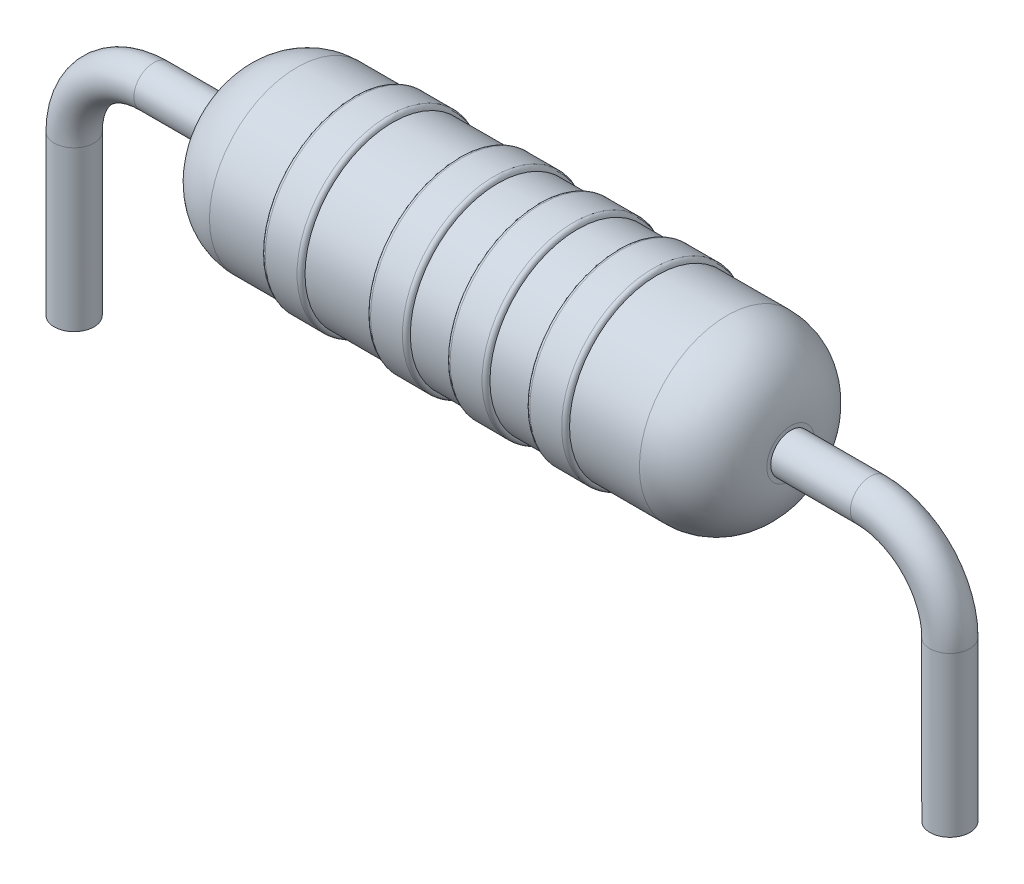
ISO-10303-21;
HEADER;
FILE_DESCRIPTION(('STEP AP214'),'2;1');
FILE_NAME('part.step','',(''),(''),'','','');
FILE_SCHEMA(('AUTOMOTIVE_DESIGN { 1 0 10303 214 1 1 1 1 }'));
ENDSEC;
DATA;
#1=APPLICATION_CONTEXT('core data for automotive mechanical design processes');
#2=APPLICATION_PROTOCOL_DEFINITION('international standard','automotive_design',2000,#1);
#3=PRODUCT_CONTEXT('',#1,'mechanical');
#4=PRODUCT('Part','Part','',(#3));
#5=PRODUCT_RELATED_PRODUCT_CATEGORY('part','',(#4));
#6=PRODUCT_DEFINITION_FORMATION('','',#4);
#7=PRODUCT_DEFINITION_CONTEXT('part definition',#1,'design');
#8=PRODUCT_DEFINITION('design','',#6,#7);
#9=PRODUCT_DEFINITION_SHAPE('','',#8);
#10=(LENGTH_UNIT() NAMED_UNIT(*) SI_UNIT(.MILLI.,.METRE.));
#11=(NAMED_UNIT(*) PLANE_ANGLE_UNIT() SI_UNIT($,.RADIAN.));
#12=(NAMED_UNIT(*) SI_UNIT($,.STERADIAN.) SOLID_ANGLE_UNIT());
#13=UNCERTAINTY_MEASURE_WITH_UNIT(LENGTH_MEASURE(1.E-05),#10,'distance_accuracy_value','');
#14=(GEOMETRIC_REPRESENTATION_CONTEXT(3) GLOBAL_UNCERTAINTY_ASSIGNED_CONTEXT((#13)) GLOBAL_UNIT_ASSIGNED_CONTEXT((#10,
#11,#12)) REPRESENTATION_CONTEXT('',''));
#15=CARTESIAN_POINT('',(0.,0.,0.));
#16=DIRECTION('',(0.,0.,1.));
#17=DIRECTION('',(1.,0.,0.));
#18=AXIS2_PLACEMENT_3D('',#15,#16,#17);
#19=CARTESIAN_POINT('',(-3.5,0.,0.));
#20=DIRECTION('',(1.,0.,0.));
#21=DIRECTION('',(0.,0.,-1.));
#22=AXIS2_PLACEMENT_3D('',#19,#20,#21);
#23=PLANE('',#22);
#24=CARTESIAN_POINT('',(-3.5,0.,0.));
#25=DIRECTION('',(-1.,0.,0.));
#26=DIRECTION('',(0.,0.,1.));
#27=AXIS2_PLACEMENT_3D('',#24,#25,#26);
#28=CIRCLE('',#27,0.299999999999995);
#29=CARTESIAN_POINT('',(-3.5,0.,0.299999999999995));
#30=VERTEX_POINT('',#29);
#31=EDGE_CURVE('E53',#30,#30,#28,.T.);
#32=ORIENTED_EDGE('',*,*,#31,.T.);
#33=EDGE_LOOP('',(#32));
#34=FACE_BOUND('',#33,.T.);
#35=CARTESIAN_POINT('',(-3.5,0.,0.));
#36=DIRECTION('',(-1.,0.,0.));
#37=DIRECTION('',(0.,0.,1.));
#38=AXIS2_PLACEMENT_3D('',#35,#36,#37);
#39=CIRCLE('',#38,0.25);
#40=CARTESIAN_POINT('',(-3.5,0.,0.25));
#41=VERTEX_POINT('',#40);
#42=EDGE_CURVE('E10',#41,#41,#39,.T.);
#43=ORIENTED_EDGE('',*,*,#42,.F.);
#44=EDGE_LOOP('',(#43));
#45=FACE_BOUND('',#44,.T.);
#46=ADVANCED_FACE('F26',(#34,#45),#23,.F.);
#47=CARTESIAN_POINT('',(-54.2686615886834,0.,0.));
#48=DIRECTION('',(-1.,0.,0.));
#49=DIRECTION('',(0.,0.,1.));
#50=AXIS2_PLACEMENT_3D('',#47,#48,#49);
#51=CYLINDRICAL_SURFACE('',#50,1.1);
#52=CARTESIAN_POINT('',(0.322975145638588,0.,0.));
#53=DIRECTION('',(-1.,0.,0.));
#54=DIRECTION('',(0.,0.,1.));
#55=AXIS2_PLACEMENT_3D('',#52,#53,#54);
#56=CIRCLE('',#55,1.1);
#57=CARTESIAN_POINT('',(0.322975145638588,0.,1.1));
#58=VERTEX_POINT('',#57);
#59=EDGE_CURVE('E73',#58,#58,#56,.T.);
#60=ORIENTED_EDGE('',*,*,#59,.T.);
#61=EDGE_LOOP('',(#60));
#62=FACE_BOUND('',#61,.T.);
#63=CARTESIAN_POINT('',(-0.177024854361413,0.,0.));
#64=DIRECTION('',(1.,0.,0.));
#65=DIRECTION('',(0.,0.,-1.));
#66=AXIS2_PLACEMENT_3D('',#63,#64,#65);
#67=CIRCLE('',#66,1.1);
#68=CARTESIAN_POINT('',(-0.177024854361413,0.,-1.1));
#69=VERTEX_POINT('',#68);
#70=EDGE_CURVE('E57',#69,#69,#67,.T.);
#71=ORIENTED_EDGE('',*,*,#70,.T.);
#72=EDGE_LOOP('',(#71));
#73=FACE_BOUND('',#72,.T.);
#74=ADVANCED_FACE('F141',(#62,#73),#51,.T.);
#75=CARTESIAN_POINT('',(4.3261723446646,0.,0.));
#76=DIRECTION('',(1.,0.,0.));
#77=DIRECTION('',(0.,0.,-1.));
#78=AXIS2_PLACEMENT_3D('',#75,#76,#77);
#79=CYLINDRICAL_SURFACE('',#78,1.15);
#80=CARTESIAN_POINT('',(-0.627024854361412,0.,0.));
#81=DIRECTION('',(-1.,0.,0.));
#82=DIRECTION('',(0.,0.,1.));
#83=AXIS2_PLACEMENT_3D('',#80,#81,#82);
#84=CIRCLE('',#83,1.15);
#85=CARTESIAN_POINT('',(-0.627024854361412,0.,1.15));
#86=VERTEX_POINT('',#85);
#87=EDGE_CURVE('E97',#86,#86,#84,.F.);
#88=ORIENTED_EDGE('',*,*,#87,.T.);
#89=EDGE_LOOP('',(#88));
#90=FACE_BOUND('',#89,.T.);
#91=CARTESIAN_POINT('',(-0.227024854361414,0.,0.));
#92=DIRECTION('',(1.,0.,0.));
#93=DIRECTION('',(0.,0.,-1.));
#94=AXIS2_PLACEMENT_3D('',#91,#92,#93);
#95=CIRCLE('',#94,1.15);
#96=CARTESIAN_POINT('',(-0.227024854361414,0.,-1.15));
#97=VERTEX_POINT('',#96);
#98=EDGE_CURVE('E94',#97,#97,#95,.F.);
#99=ORIENTED_EDGE('',*,*,#98,.T.);
#100=EDGE_LOOP('',(#99));
#101=FACE_BOUND('',#100,.T.);
#102=ADVANCED_FACE('F147',(#90,#101),#79,.T.);
#103=CARTESIAN_POINT('',(-1.5,0.,0.));
#104=DIRECTION('',(1.,0.,0.));
#105=DIRECTION('',(0.,0.,-1.));
#106=AXIS2_PLACEMENT_3D('',#103,#104,#105);
#107=CIRCLE('',#106,1.1);
#108=CARTESIAN_POINT('',(-1.5,0.,-1.1));
#109=VERTEX_POINT('',#108);
#110=EDGE_CURVE('E52',#109,#109,#107,.T.);
#111=ORIENTED_EDGE('',*,*,#110,.T.);
#112=EDGE_LOOP('',(#111));
#113=FACE_BOUND('',#112,.T.);
#114=CARTESIAN_POINT('',(-0.677024854361413,0.,0.));
#115=DIRECTION('',(-1.,0.,0.));
#116=DIRECTION('',(0.,0.,1.));
#117=AXIS2_PLACEMENT_3D('',#114,#115,#116);
#118=CIRCLE('',#117,1.1);
#119=CARTESIAN_POINT('',(-0.677024854361413,0.,1.1));
#120=VERTEX_POINT('',#119);
#121=EDGE_CURVE('E67',#120,#120,#118,.T.);
#122=ORIENTED_EDGE('',*,*,#121,.T.);
#123=EDGE_LOOP('',(#122));
#124=FACE_BOUND('',#123,.T.);
#125=ADVANCED_FACE('F149',(#113,#124),#51,.T.);
#126=CARTESIAN_POINT('',(4.3261723446646,0.,0.));
#127=DIRECTION('',(1.,0.,0.));
#128=DIRECTION('',(0.,0.,-1.));
#129=AXIS2_PLACEMENT_3D('',#126,#127,#128);
#130=CYLINDRICAL_SURFACE('',#129,1.15);
#131=CARTESIAN_POINT('',(0.372975145638589,0.,0.));
#132=DIRECTION('',(-1.,0.,0.));
#133=DIRECTION('',(0.,0.,1.));
#134=AXIS2_PLACEMENT_3D('',#131,#132,#133);
#135=CIRCLE('',#134,1.15);
#136=CARTESIAN_POINT('',(0.372975145638589,0.,1.15));
#137=VERTEX_POINT('',#136);
#138=EDGE_CURVE('E103',#137,#137,#135,.F.);
#139=ORIENTED_EDGE('',*,*,#138,.T.);
#140=EDGE_LOOP('',(#139));
#141=FACE_BOUND('',#140,.T.);
#142=CARTESIAN_POINT('',(0.772975145638587,0.,0.));
#143=DIRECTION('',(1.,0.,0.));
#144=DIRECTION('',(0.,0.,-1.));
#145=AXIS2_PLACEMENT_3D('',#142,#143,#144);
#146=CIRCLE('',#145,1.15);
#147=CARTESIAN_POINT('',(0.772975145638587,0.,-1.15));
#148=VERTEX_POINT('',#147);
#149=EDGE_CURVE('E100',#148,#148,#146,.F.);
#150=ORIENTED_EDGE('',*,*,#149,.T.);
#151=EDGE_LOOP('',(#150));
#152=FACE_BOUND('',#151,.T.);
#153=ADVANCED_FACE('F158',(#141,#152),#130,.T.);
#154=CARTESIAN_POINT('',(1.32297514563859,0.,0.));
#155=DIRECTION('',(-1.,0.,0.));
#156=DIRECTION('',(0.,0.,1.));
#157=AXIS2_PLACEMENT_3D('',#154,#155,#156);
#158=CIRCLE('',#157,1.1);
#159=CARTESIAN_POINT('',(1.32297514563859,0.,1.1));
#160=VERTEX_POINT('',#159);
#161=EDGE_CURVE('E79',#160,#160,#158,.T.);
#162=ORIENTED_EDGE('',*,*,#161,.T.);
#163=EDGE_LOOP('',(#162));
#164=FACE_BOUND('',#163,.T.);
#165=CARTESIAN_POINT('',(0.822975145638588,0.,0.));
#166=DIRECTION('',(1.,0.,0.));
#167=DIRECTION('',(0.,0.,-1.));
#168=AXIS2_PLACEMENT_3D('',#165,#166,#167);
#169=CIRCLE('',#168,1.1);
#170=CARTESIAN_POINT('',(0.822975145638588,0.,-1.1));
#171=VERTEX_POINT('',#170);
#172=EDGE_CURVE('E70',#171,#171,#169,.T.);
#173=ORIENTED_EDGE('',*,*,#172,.T.);
#174=EDGE_LOOP('',(#173));
#175=FACE_BOUND('',#174,.T.);
#176=ADVANCED_FACE('F124',(#164,#175),#51,.T.);
#177=CARTESIAN_POINT('',(4.3261723446646,0.,0.));
#178=DIRECTION('',(1.,0.,0.));
#179=DIRECTION('',(0.,0.,-1.));
#180=AXIS2_PLACEMENT_3D('',#177,#178,#179);
#181=CYLINDRICAL_SURFACE('',#180,1.15);
#182=CARTESIAN_POINT('',(1.37297514563859,0.,0.));
#183=DIRECTION('',(-1.,0.,0.));
#184=DIRECTION('',(0.,0.,1.));
#185=AXIS2_PLACEMENT_3D('',#182,#183,#184);
#186=CIRCLE('',#185,1.15);
#187=CARTESIAN_POINT('',(1.37297514563859,0.,1.15));
#188=VERTEX_POINT('',#187);
#189=EDGE_CURVE('E30',#188,#188,#186,.F.);
#190=ORIENTED_EDGE('',*,*,#189,.T.);
#191=EDGE_LOOP('',(#190));
#192=FACE_BOUND('',#191,.T.);
#193=CARTESIAN_POINT('',(1.77297514563859,0.,0.));
#194=DIRECTION('',(1.,0.,0.));
#195=DIRECTION('',(0.,0.,-1.));
#196=AXIS2_PLACEMENT_3D('',#193,#194,#195);
#197=CIRCLE('',#196,1.15);
#198=CARTESIAN_POINT('',(1.77297514563859,0.,-1.15));
#199=VERTEX_POINT('',#198);
#200=EDGE_CURVE('E38',#199,#199,#197,.F.);
#201=ORIENTED_EDGE('',*,*,#200,.T.);
#202=EDGE_LOOP('',(#201));
#203=FACE_BOUND('',#202,.T.);
#204=ADVANCED_FACE('F108',(#192,#203),#181,.T.);
#205=CARTESIAN_POINT('',(3.5,0.299999999999995,0.));
#206=DIRECTION('',(-1.,0.,0.));
#207=DIRECTION('',(0.,0.,1.));
#208=AXIS2_PLACEMENT_3D('',#205,#206,#207);
#209=PLANE('',#208);
#210=CARTESIAN_POINT('',(3.5,0.,0.));
#211=DIRECTION('',(-1.,0.,0.));
#212=DIRECTION('',(0.,0.,1.));
#213=AXIS2_PLACEMENT_3D('',#210,#211,#212);
#214=CIRCLE('',#213,0.25);
#215=CARTESIAN_POINT('',(3.5,0.,0.25));
#216=VERTEX_POINT('',#215);
#217=EDGE_CURVE('E255',#216,#216,#214,.T.);
#218=ORIENTED_EDGE('',*,*,#217,.T.);
#219=EDGE_LOOP('',(#218));
#220=FACE_BOUND('',#219,.T.);
#221=CARTESIAN_POINT('',(3.5,0.,0.));
#222=DIRECTION('',(-1.,0.,0.));
#223=DIRECTION('',(0.,0.,1.));
#224=AXIS2_PLACEMENT_3D('',#221,#222,#223);
#225=CIRCLE('',#224,0.299999999999995);
#226=CARTESIAN_POINT('',(3.5,0.,0.299999999999995));
#227=VERTEX_POINT('',#226);
#228=EDGE_CURVE('E63',#227,#227,#225,.T.);
#229=ORIENTED_EDGE('',*,*,#228,.F.);
#230=EDGE_LOOP('',(#229));
#231=FACE_BOUND('',#230,.T.);
#232=ADVANCED_FACE('F28',(#220,#231),#209,.F.);
#233=CARTESIAN_POINT('',(2.7,0.,0.));
#234=DIRECTION('',(-1.,0.,0.));
#235=DIRECTION('',(0.,0.,1.));
#236=AXIS2_PLACEMENT_3D('',#233,#234,#235);
#237=DEGENERATE_TOROIDAL_SURFACE('',#236,0.3,0.8,.T.);
#238=CARTESIAN_POINT('',(2.69999999999999,0.,0.));
#239=DIRECTION('',(-1.,0.,0.));
#240=DIRECTION('',(0.,0.,1.));
#241=AXIS2_PLACEMENT_3D('',#238,#239,#240);
#242=CIRCLE('',#241,1.1);
#243=CARTESIAN_POINT('',(2.69999999999999,0.,1.1));
#244=VERTEX_POINT('',#243);
#245=EDGE_CURVE('E60',#244,#244,#242,.T.);
#246=ORIENTED_EDGE('',*,*,#245,.F.);
#247=EDGE_LOOP('',(#246));
#248=FACE_BOUND('',#247,.T.);
#249=ORIENTED_EDGE('',*,*,#228,.T.);
#250=EDGE_LOOP('',(#249));
#251=FACE_BOUND('',#250,.T.);
#252=ADVANCED_FACE('F122',(#248,#251),#237,.T.);
#253=CARTESIAN_POINT('',(1.82297514563859,0.,0.));
#254=DIRECTION('',(1.,0.,0.));
#255=DIRECTION('',(0.,0.,-1.));
#256=AXIS2_PLACEMENT_3D('',#253,#254,#255);
#257=CIRCLE('',#256,1.1);
#258=CARTESIAN_POINT('',(1.82297514563859,0.,-1.1));
#259=VERTEX_POINT('',#258);
#260=EDGE_CURVE('E76',#259,#259,#257,.T.);
#261=ORIENTED_EDGE('',*,*,#260,.T.);
#262=EDGE_LOOP('',(#261));
#263=FACE_BOUND('',#262,.T.);
#264=ORIENTED_EDGE('',*,*,#245,.T.);
#265=EDGE_LOOP('',(#264));
#266=FACE_BOUND('',#265,.T.);
#267=ADVANCED_FACE('F118',(#263,#266),#51,.T.);
#268=CARTESIAN_POINT('',(4.3261723446646,0.,0.));
#269=DIRECTION('',(1.,0.,0.));
#270=DIRECTION('',(0.,0.,-1.));
#271=AXIS2_PLACEMENT_3D('',#268,#269,#270);
#272=CYLINDRICAL_SURFACE('',#271,1.15);
#273=CARTESIAN_POINT('',(-1.95,0.,0.));
#274=DIRECTION('',(-1.,0.,0.));
#275=DIRECTION('',(0.,0.,1.));
#276=AXIS2_PLACEMENT_3D('',#273,#274,#275);
#277=CIRCLE('',#276,1.15);
#278=CARTESIAN_POINT('',(-1.95,0.,1.15));
#279=VERTEX_POINT('',#278);
#280=EDGE_CURVE('E91',#279,#279,#277,.F.);
#281=ORIENTED_EDGE('',*,*,#280,.T.);
#282=EDGE_LOOP('',(#281));
#283=FACE_BOUND('',#282,.T.);
#284=CARTESIAN_POINT('',(-1.55,0.,0.));
#285=DIRECTION('',(1.,0.,0.));
#286=DIRECTION('',(0.,0.,-1.));
#287=AXIS2_PLACEMENT_3D('',#284,#285,#286);
#288=CIRCLE('',#287,1.15);
#289=CARTESIAN_POINT('',(-1.55,0.,-1.15));
#290=VERTEX_POINT('',#289);
#291=EDGE_CURVE('E66',#290,#290,#288,.F.);
#292=ORIENTED_EDGE('',*,*,#291,.T.);
#293=EDGE_LOOP('',(#292));
#294=FACE_BOUND('',#293,.T.);
#295=ADVANCED_FACE('F121',(#283,#294),#272,.T.);
#296=CARTESIAN_POINT('',(-2.7,0.,0.));
#297=DIRECTION('',(-1.,0.,0.));
#298=DIRECTION('',(0.,0.,1.));
#299=AXIS2_PLACEMENT_3D('',#296,#297,#298);
#300=DEGENERATE_TOROIDAL_SURFACE('',#299,0.3,0.8,.T.);
#301=ORIENTED_EDGE('',*,*,#31,.F.);
#302=EDGE_LOOP('',(#301));
#303=FACE_BOUND('',#302,.T.);
#304=CARTESIAN_POINT('',(-2.69999999999999,0.,0.));
#305=DIRECTION('',(-1.,0.,0.));
#306=DIRECTION('',(0.,0.,1.));
#307=AXIS2_PLACEMENT_3D('',#304,#305,#306);
#308=CIRCLE('',#307,1.1);
#309=CARTESIAN_POINT('',(-2.69999999999999,0.,1.1));
#310=VERTEX_POINT('',#309);
#311=EDGE_CURVE('E56',#310,#310,#308,.T.);
#312=ORIENTED_EDGE('',*,*,#311,.T.);
#313=EDGE_LOOP('',(#312));
#314=FACE_BOUND('',#313,.T.);
#315=ADVANCED_FACE('F154',(#303,#314),#300,.T.);
#316=CARTESIAN_POINT('',(-2.,0.,0.));
#317=DIRECTION('',(-1.,0.,0.));
#318=DIRECTION('',(0.,0.,1.));
#319=AXIS2_PLACEMENT_3D('',#316,#317,#318);
#320=CIRCLE('',#319,1.1);
#321=CARTESIAN_POINT('',(-2.,0.,1.1));
#322=VERTEX_POINT('',#321);
#323=EDGE_CURVE('E82',#322,#322,#320,.T.);
#324=ORIENTED_EDGE('',*,*,#323,.T.);
#325=EDGE_LOOP('',(#324));
#326=FACE_BOUND('',#325,.T.);
#327=ORIENTED_EDGE('',*,*,#311,.F.);
#328=EDGE_LOOP('',(#327));
#329=FACE_BOUND('',#328,.T.);
#330=ADVANCED_FACE('F125',(#326,#329),#51,.T.);
#331=CARTESIAN_POINT('',(-1.95,0.,0.));
#332=DIRECTION('',(-1.,0.,0.));
#333=DIRECTION('',(0.,0.,1.));
#334=AXIS2_PLACEMENT_3D('',#331,#332,#333);
#335=TOROIDAL_SURFACE('',#334,1.1,0.05);
#336=ORIENTED_EDGE('',*,*,#323,.F.);
#337=EDGE_LOOP('',(#336));
#338=FACE_BOUND('',#337,.T.);
#339=ORIENTED_EDGE('',*,*,#280,.F.);
#340=EDGE_LOOP('',(#339));
#341=FACE_BOUND('',#340,.T.);
#342=ADVANCED_FACE('F168',(#338,#341),#335,.T.);
#343=CARTESIAN_POINT('',(-1.55,0.,0.));
#344=DIRECTION('',(1.,0.,0.));
#345=DIRECTION('',(0.,0.,-1.));
#346=AXIS2_PLACEMENT_3D('',#343,#344,#345);
#347=TOROIDAL_SURFACE('',#346,1.1,0.05);
#348=ORIENTED_EDGE('',*,*,#291,.F.);
#349=EDGE_LOOP('',(#348));
#350=FACE_BOUND('',#349,.T.);
#351=ORIENTED_EDGE('',*,*,#110,.F.);
#352=EDGE_LOOP('',(#351));
#353=FACE_BOUND('',#352,.T.);
#354=ADVANCED_FACE('F173',(#350,#353),#347,.T.);
#355=CARTESIAN_POINT('',(-0.627024854361412,0.,0.));
#356=DIRECTION('',(-1.,0.,0.));
#357=DIRECTION('',(0.,0.,1.));
#358=AXIS2_PLACEMENT_3D('',#355,#356,#357);
#359=TOROIDAL_SURFACE('',#358,1.1,0.05);
#360=ORIENTED_EDGE('',*,*,#121,.F.);
#361=EDGE_LOOP('',(#360));
#362=FACE_BOUND('',#361,.T.);
#363=ORIENTED_EDGE('',*,*,#87,.F.);
#364=EDGE_LOOP('',(#363));
#365=FACE_BOUND('',#364,.T.);
#366=ADVANCED_FACE('F190',(#362,#365),#359,.T.);
#367=CARTESIAN_POINT('',(-0.227024854361414,0.,0.));
#368=DIRECTION('',(1.,0.,0.));
#369=DIRECTION('',(0.,0.,-1.));
#370=AXIS2_PLACEMENT_3D('',#367,#368,#369);
#371=TOROIDAL_SURFACE('',#370,1.1,0.05);
#372=ORIENTED_EDGE('',*,*,#98,.F.);
#373=EDGE_LOOP('',(#372));
#374=FACE_BOUND('',#373,.T.);
#375=ORIENTED_EDGE('',*,*,#70,.F.);
#376=EDGE_LOOP('',(#375));
#377=FACE_BOUND('',#376,.T.);
#378=ADVANCED_FACE('F196',(#374,#377),#371,.T.);
#379=CARTESIAN_POINT('',(0.372975145638589,0.,0.));
#380=DIRECTION('',(-1.,0.,0.));
#381=DIRECTION('',(0.,0.,1.));
#382=AXIS2_PLACEMENT_3D('',#379,#380,#381);
#383=TOROIDAL_SURFACE('',#382,1.1,0.05);
#384=ORIENTED_EDGE('',*,*,#59,.F.);
#385=EDGE_LOOP('',(#384));
#386=FACE_BOUND('',#385,.T.);
#387=ORIENTED_EDGE('',*,*,#138,.F.);
#388=EDGE_LOOP('',(#387));
#389=FACE_BOUND('',#388,.T.);
#390=ADVANCED_FACE('F202',(#386,#389),#383,.T.);
#391=CARTESIAN_POINT('',(0.772975145638587,0.,0.));
#392=DIRECTION('',(1.,0.,0.));
#393=DIRECTION('',(0.,0.,-1.));
#394=AXIS2_PLACEMENT_3D('',#391,#392,#393);
#395=TOROIDAL_SURFACE('',#394,1.1,0.05);
#396=ORIENTED_EDGE('',*,*,#149,.F.);
#397=EDGE_LOOP('',(#396));
#398=FACE_BOUND('',#397,.T.);
#399=ORIENTED_EDGE('',*,*,#172,.F.);
#400=EDGE_LOOP('',(#399));
#401=FACE_BOUND('',#400,.T.);
#402=ADVANCED_FACE('F206',(#398,#401),#395,.T.);
#403=CARTESIAN_POINT('',(1.37297514563859,0.,0.));
#404=DIRECTION('',(-1.,0.,0.));
#405=DIRECTION('',(0.,0.,1.));
#406=AXIS2_PLACEMENT_3D('',#403,#404,#405);
#407=TOROIDAL_SURFACE('',#406,1.1,0.05);
#408=ORIENTED_EDGE('',*,*,#161,.F.);
#409=EDGE_LOOP('',(#408));
#410=FACE_BOUND('',#409,.T.);
#411=ORIENTED_EDGE('',*,*,#189,.F.);
#412=EDGE_LOOP('',(#411));
#413=FACE_BOUND('',#412,.T.);
#414=ADVANCED_FACE('F114',(#410,#413),#407,.T.);
#415=CARTESIAN_POINT('',(1.77297514563859,0.,0.));
#416=DIRECTION('',(1.,0.,0.));
#417=DIRECTION('',(0.,0.,-1.));
#418=AXIS2_PLACEMENT_3D('',#415,#416,#417);
#419=TOROIDAL_SURFACE('',#418,1.1,0.05);
#420=ORIENTED_EDGE('',*,*,#200,.F.);
#421=EDGE_LOOP('',(#420));
#422=FACE_BOUND('',#421,.T.);
#423=ORIENTED_EDGE('',*,*,#260,.F.);
#424=EDGE_LOOP('',(#423));
#425=FACE_BOUND('',#424,.T.);
#426=ADVANCED_FACE('F110',(#422,#425),#419,.T.);
#427=CARTESIAN_POINT('',(-5.5,-1.00000000000001,0.));
#428=DIRECTION('',(0.,-1.,0.));
#429=DIRECTION('',(0.,0.,-1.));
#430=AXIS2_PLACEMENT_3D('',#427,#428,#429);
#431=CYLINDRICAL_SURFACE('',#430,0.25);
#432=CARTESIAN_POINT('',(-5.5,-1.00000000000001,0.));
#433=DIRECTION('',(0.,-1.,0.));
#434=DIRECTION('',(0.,0.,1.));
#435=AXIS2_PLACEMENT_3D('',#432,#433,#434);
#436=CIRCLE('',#435,0.25);
#437=CARTESIAN_POINT('',(-5.75,-1.00000000000001,0.));
#438=VERTEX_POINT('',#437);
#439=EDGE_CURVE('E46',#438,#438,#436,.T.);
#440=ORIENTED_EDGE('',*,*,#439,.T.);
#441=EDGE_LOOP('',(#440));
#442=FACE_BOUND('',#441,.T.);
#443=CARTESIAN_POINT('',(-5.5,-3.,0.));
#444=DIRECTION('',(0.,-1.,0.));
#445=DIRECTION('',(0.,0.,1.));
#446=AXIS2_PLACEMENT_3D('',#443,#444,#445);
#447=CIRCLE('',#446,0.25);
#448=CARTESIAN_POINT('',(-5.5,-3.,0.25));
#449=VERTEX_POINT('',#448);
#450=EDGE_CURVE('E49',#449,#449,#447,.T.);
#451=ORIENTED_EDGE('',*,*,#450,.F.);
#452=EDGE_LOOP('',(#451));
#453=FACE_BOUND('',#452,.T.);
#454=ADVANCED_FACE('F113',(#442,#453),#431,.T.);
#455=CARTESIAN_POINT('',(-4.5,-1.,0.));
#456=DIRECTION('',(0.,0.,1.));
#457=DIRECTION('',(1.,0.,0.));
#458=AXIS2_PLACEMENT_3D('',#455,#456,#457);
#459=TOROIDAL_SURFACE('',#458,1.,0.25);
#460=CARTESIAN_POINT('',(-4.49999999999999,0.,0.));
#461=DIRECTION('',(-1.,0.,0.));
#462=DIRECTION('',(0.,0.,1.));
#463=AXIS2_PLACEMENT_3D('',#460,#461,#462);
#464=CIRCLE('',#463,0.25);
#465=CARTESIAN_POINT('',(-4.49999999999999,0.25,0.));
#466=VERTEX_POINT('',#465);
#467=EDGE_CURVE('E43',#466,#466,#464,.T.);
#468=CARTESIAN_POINT('',(-4.5,-1.,0.));
#469=DIRECTION('',(0.,0.,1.));
#470=DIRECTION('',(1.,0.,0.));
#471=AXIS2_PLACEMENT_3D('',#468,#469,#470);
#472=CIRCLE('',#471,1.25);
#473=EDGE_CURVE('',#466,#438,#472,.T.);
#474=ORIENTED_EDGE('',*,*,#467,.T.);
#475=ORIENTED_EDGE('',*,*,#439,.F.);
#476=ORIENTED_EDGE('',*,*,#473,.T.);
#477=ORIENTED_EDGE('',*,*,#473,.F.);
#478=EDGE_LOOP('',(#474,#476,#475,#477));
#479=FACE_BOUND('',#478,.T.);
#480=ADVANCED_FACE('F216',(#479),#459,.T.);
#481=CARTESIAN_POINT('',(-4.49999999999999,0.,0.));
#482=DIRECTION('',(1.,0.,0.));
#483=DIRECTION('',(0.,0.,-1.));
#484=AXIS2_PLACEMENT_3D('',#481,#482,#483);
#485=CYLINDRICAL_SURFACE('',#484,0.25);
#486=ORIENTED_EDGE('',*,*,#467,.F.);
#487=EDGE_LOOP('',(#486));
#488=FACE_BOUND('',#487,.T.);
#489=ORIENTED_EDGE('',*,*,#42,.T.);
#490=EDGE_LOOP('',(#489));
#491=FACE_BOUND('',#490,.T.);
#492=ADVANCED_FACE('F220',(#488,#491),#485,.T.);
#493=CARTESIAN_POINT('',(-5.5,-3.,0.));
#494=DIRECTION('',(0.,-1.,0.));
#495=DIRECTION('',(0.,0.,1.));
#496=AXIS2_PLACEMENT_3D('',#493,#494,#495);
#497=PLANE('',#496);
#498=ORIENTED_EDGE('',*,*,#450,.T.);
#499=EDGE_LOOP('',(#498));
#500=FACE_BOUND('',#499,.T.);
#501=ADVANCED_FACE('F224',(#500),#497,.T.);
#502=CARTESIAN_POINT('',(5.5,-1.00000000000001,0.));
#503=DIRECTION('',(0.,-1.,0.));
#504=DIRECTION('',(0.,0.,-1.));
#505=AXIS2_PLACEMENT_3D('',#502,#503,#504);
#506=CYLINDRICAL_SURFACE('',#505,0.25);
#507=CARTESIAN_POINT('',(5.5,-1.00000000000001,0.));
#508=DIRECTION('',(0.,1.,0.));
#509=DIRECTION('',(0.,0.,1.));
#510=AXIS2_PLACEMENT_3D('',#507,#508,#509);
#511=CIRCLE('',#510,0.25);
#512=CARTESIAN_POINT('',(5.75,-1.00000000000001,0.));
#513=VERTEX_POINT('',#512);
#514=EDGE_CURVE('E249',#513,#513,#511,.T.);
#515=ORIENTED_EDGE('',*,*,#514,.F.);
#516=EDGE_LOOP('',(#515));
#517=FACE_BOUND('',#516,.T.);
#518=CARTESIAN_POINT('',(5.5,-3.,0.));
#519=DIRECTION('',(0.,1.,0.));
#520=DIRECTION('',(0.,0.,1.));
#521=AXIS2_PLACEMENT_3D('',#518,#519,#520);
#522=CIRCLE('',#521,0.25);
#523=CARTESIAN_POINT('',(5.5,-3.,0.25));
#524=VERTEX_POINT('',#523);
#525=EDGE_CURVE('E41',#524,#524,#522,.T.);
#526=ORIENTED_EDGE('',*,*,#525,.T.);
#527=EDGE_LOOP('',(#526));
#528=FACE_BOUND('',#527,.T.);
#529=ADVANCED_FACE('F228',(#517,#528),#506,.T.);
#530=CARTESIAN_POINT('',(4.5,-1.,0.));
#531=DIRECTION('',(0.,0.,-1.));
#532=DIRECTION('',(-1.,0.,0.));
#533=AXIS2_PLACEMENT_3D('',#530,#531,#532);
#534=TOROIDAL_SURFACE('',#533,1.,0.25);
#535=CARTESIAN_POINT('',(4.49999999999999,0.,0.));
#536=DIRECTION('',(-1.,0.,0.));
#537=DIRECTION('',(0.,0.,1.));
#538=AXIS2_PLACEMENT_3D('',#535,#536,#537);
#539=CIRCLE('',#538,0.25);
#540=CARTESIAN_POINT('',(4.49999999999999,0.25,0.));
#541=VERTEX_POINT('',#540);
#542=EDGE_CURVE('E251',#541,#541,#539,.T.);
#543=CARTESIAN_POINT('',(4.5,-1.,0.));
#544=DIRECTION('',(0.,0.,-1.));
#545=DIRECTION('',(-1.,0.,0.));
#546=AXIS2_PLACEMENT_3D('',#543,#544,#545);
#547=CIRCLE('',#546,1.25);
#548=EDGE_CURVE('',#541,#513,#547,.T.);
#549=ORIENTED_EDGE('',*,*,#542,.F.);
#550=ORIENTED_EDGE('',*,*,#514,.T.);
#551=ORIENTED_EDGE('',*,*,#548,.T.);
#552=ORIENTED_EDGE('',*,*,#548,.F.);
#553=EDGE_LOOP('',(#549,#551,#550,#552));
#554=FACE_BOUND('',#553,.T.);
#555=ADVANCED_FACE('F232',(#554),#534,.T.);
#556=CARTESIAN_POINT('',(4.49999999999999,0.,0.));
#557=DIRECTION('',(-1.,0.,0.));
#558=DIRECTION('',(0.,0.,1.));
#559=AXIS2_PLACEMENT_3D('',#556,#557,#558);
#560=CYLINDRICAL_SURFACE('',#559,0.25);
#561=ORIENTED_EDGE('',*,*,#542,.T.);
#562=EDGE_LOOP('',(#561));
#563=FACE_BOUND('',#562,.T.);
#564=ORIENTED_EDGE('',*,*,#217,.F.);
#565=EDGE_LOOP('',(#564));
#566=FACE_BOUND('',#565,.T.);
#567=ADVANCED_FACE('F236',(#563,#566),#560,.T.);
#568=CARTESIAN_POINT('',(5.5,-3.,0.));
#569=DIRECTION('',(0.,-1.,0.));
#570=DIRECTION('',(0.,0.,1.));
#571=AXIS2_PLACEMENT_3D('',#568,#569,#570);
#572=PLANE('',#571);
#573=ORIENTED_EDGE('',*,*,#525,.F.);
#574=EDGE_LOOP('',(#573));
#575=FACE_BOUND('',#574,.T.);
#576=ADVANCED_FACE('F240',(#575),#572,.T.);
#577=CLOSED_SHELL('',(#46,#74,#102,#125,#153,#176,#204,#232,#252,#267,#295,#315,#330,#342,#354,
#366,#378,#390,#402,#414,#426,#454,#480,#492,#501,#529,#555,#567,#576));
#578=MANIFOLD_SOLID_BREP('B2',#577);
#579=ADVANCED_BREP_SHAPE_REPRESENTATION('',(#18,#578),#14);
#580=SHAPE_DEFINITION_REPRESENTATION(#9,#579);
ENDSEC;
END-ISO-10303-21;
